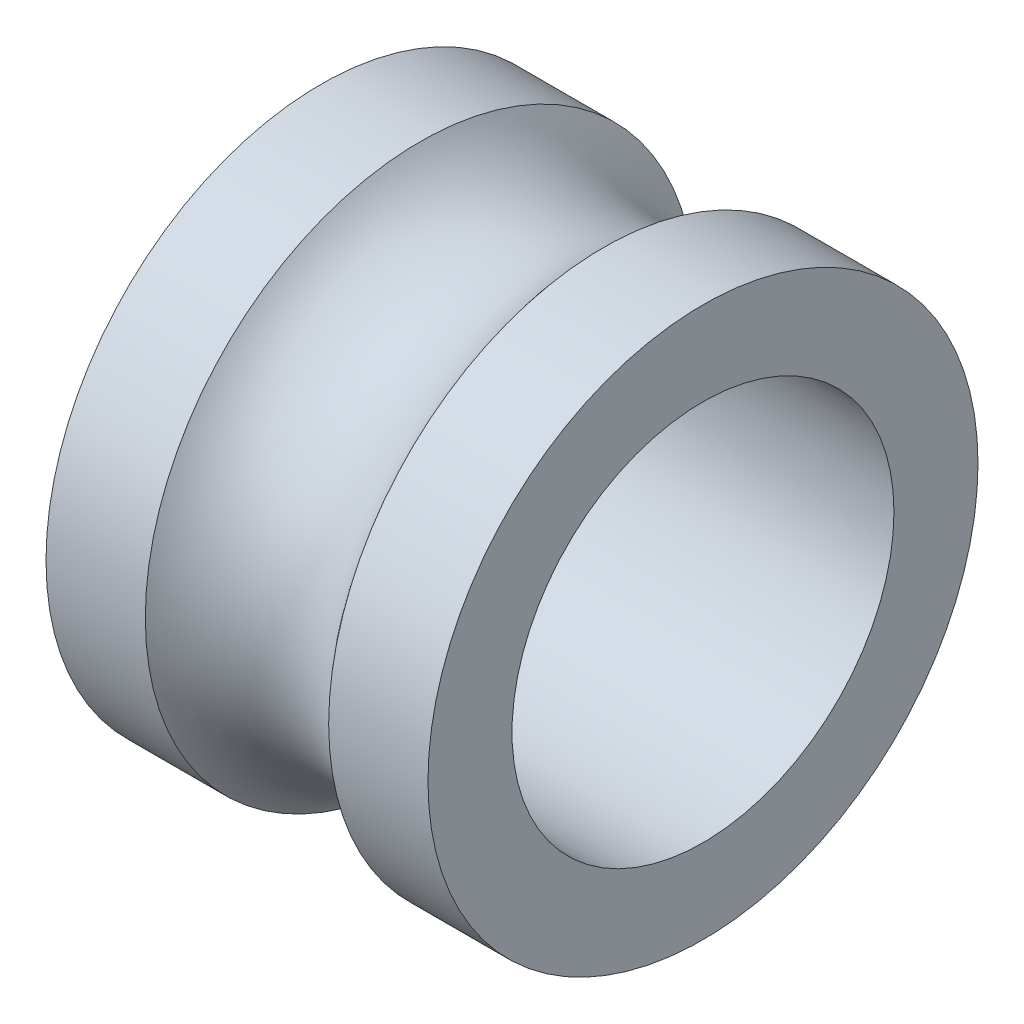
ISO-10303-21;
HEADER;
FILE_DESCRIPTION(('STEP AP214'),'2;1');
FILE_NAME('part.step','',(''),(''),'','','');
FILE_SCHEMA(('AUTOMOTIVE_DESIGN { 1 0 10303 214 1 1 1 1 }'));
ENDSEC;
DATA;
#1=APPLICATION_CONTEXT('core data for automotive mechanical design processes');
#2=APPLICATION_PROTOCOL_DEFINITION('international standard','automotive_design',2000,#1);
#3=PRODUCT_CONTEXT('',#1,'mechanical');
#4=PRODUCT('Part','Part','',(#3));
#5=PRODUCT_RELATED_PRODUCT_CATEGORY('part','',(#4));
#6=PRODUCT_DEFINITION_FORMATION('','',#4);
#7=PRODUCT_DEFINITION_CONTEXT('part definition',#1,'design');
#8=PRODUCT_DEFINITION('design','',#6,#7);
#9=PRODUCT_DEFINITION_SHAPE('','',#8);
#10=(LENGTH_UNIT() NAMED_UNIT(*) SI_UNIT(.MILLI.,.METRE.));
#11=(NAMED_UNIT(*) PLANE_ANGLE_UNIT() SI_UNIT($,.RADIAN.));
#12=(NAMED_UNIT(*) SI_UNIT($,.STERADIAN.) SOLID_ANGLE_UNIT());
#13=UNCERTAINTY_MEASURE_WITH_UNIT(LENGTH_MEASURE(1.E-05),#10,'distance_accuracy_value','');
#14=(GEOMETRIC_REPRESENTATION_CONTEXT(3) GLOBAL_UNCERTAINTY_ASSIGNED_CONTEXT((#13)) GLOBAL_UNIT_ASSIGNED_CONTEXT((#10,
#11,#12)) REPRESENTATION_CONTEXT('',''));
#15=CARTESIAN_POINT('',(0.,0.,0.));
#16=DIRECTION('',(0.,0.,1.));
#17=DIRECTION('',(1.,0.,0.));
#18=AXIS2_PLACEMENT_3D('',#15,#16,#17);
#19=CARTESIAN_POINT('',(2.5,3.6,0.));
#20=DIRECTION('',(1.,0.,0.));
#21=DIRECTION('',(0.,0.,-1.));
#22=AXIS2_PLACEMENT_3D('',#19,#20,#21);
#23=PLANE('',#22);
#24=CARTESIAN_POINT('',(2.5,0.,0.));
#25=DIRECTION('',(1.,0.,0.));
#26=DIRECTION('',(0.,0.,-1.));
#27=AXIS2_PLACEMENT_3D('',#24,#25,#26);
#28=CIRCLE('',#27,3.6);
#29=CARTESIAN_POINT('',(2.5,0.,-3.6));
#30=VERTEX_POINT('',#29);
#31=EDGE_CURVE('E59',#30,#30,#28,.T.);
#32=ORIENTED_EDGE('',*,*,#31,.T.);
#33=EDGE_LOOP('',(#32));
#34=FACE_BOUND('',#33,.T.);
#35=CARTESIAN_POINT('',(2.5,0.,0.));
#36=DIRECTION('',(1.,0.,0.));
#37=DIRECTION('',(0.,0.,-1.));
#38=AXIS2_PLACEMENT_3D('',#35,#36,#37);
#39=CIRCLE('',#38,2.5);
#40=CARTESIAN_POINT('',(2.5,0.,-2.5));
#41=VERTEX_POINT('',#40);
#42=EDGE_CURVE('E10',#41,#41,#39,.T.);
#43=ORIENTED_EDGE('',*,*,#42,.F.);
#44=EDGE_LOOP('',(#43));
#45=FACE_BOUND('',#44,.T.);
#46=ADVANCED_FACE('F37',(#34,#45),#23,.T.);
#47=CARTESIAN_POINT('',(0.,0.,0.));
#48=DIRECTION('',(1.,0.,0.));
#49=DIRECTION('',(0.,0.,-1.));
#50=AXIS2_PLACEMENT_3D('',#47,#48,#49);
#51=CYLINDRICAL_SURFACE('',#50,2.5);
#52=ORIENTED_EDGE('',*,*,#42,.T.);
#53=EDGE_LOOP('',(#52));
#54=FACE_BOUND('',#53,.T.);
#55=CARTESIAN_POINT('',(-2.5,0.,0.));
#56=DIRECTION('',(1.,0.,0.));
#57=DIRECTION('',(0.,0.,-1.));
#58=AXIS2_PLACEMENT_3D('',#55,#56,#57);
#59=CIRCLE('',#58,2.5);
#60=CARTESIAN_POINT('',(-2.5,0.,-2.5));
#61=VERTEX_POINT('',#60);
#62=EDGE_CURVE('E43',#61,#61,#59,.T.);
#63=ORIENTED_EDGE('',*,*,#62,.F.);
#64=EDGE_LOOP('',(#63));
#65=FACE_BOUND('',#64,.T.);
#66=ADVANCED_FACE('F77',(#54,#65),#51,.F.);
#67=CARTESIAN_POINT('',(-2.5,2.5,0.));
#68=DIRECTION('',(-1.,0.,0.));
#69=DIRECTION('',(0.,0.,1.));
#70=AXIS2_PLACEMENT_3D('',#67,#68,#69);
#71=PLANE('',#70);
#72=ORIENTED_EDGE('',*,*,#62,.T.);
#73=EDGE_LOOP('',(#72));
#74=FACE_BOUND('',#73,.T.);
#75=CARTESIAN_POINT('',(-2.5,0.,0.));
#76=DIRECTION('',(1.,0.,0.));
#77=DIRECTION('',(0.,0.,-1.));
#78=AXIS2_PLACEMENT_3D('',#75,#76,#77);
#79=CIRCLE('',#78,3.6);
#80=CARTESIAN_POINT('',(-2.5,0.,-3.6));
#81=VERTEX_POINT('',#80);
#82=EDGE_CURVE('E47',#81,#81,#79,.T.);
#83=ORIENTED_EDGE('',*,*,#82,.F.);
#84=EDGE_LOOP('',(#83));
#85=FACE_BOUND('',#84,.T.);
#86=ADVANCED_FACE('F81',(#74,#85),#71,.T.);
#87=CARTESIAN_POINT('',(0.,0.,0.));
#88=DIRECTION('',(1.,0.,0.));
#89=DIRECTION('',(0.,0.,-1.));
#90=AXIS2_PLACEMENT_3D('',#87,#88,#89);
#91=CYLINDRICAL_SURFACE('',#90,3.6);
#92=ORIENTED_EDGE('',*,*,#82,.T.);
#93=EDGE_LOOP('',(#92));
#94=FACE_BOUND('',#93,.T.);
#95=CARTESIAN_POINT('',(-1.2,0.,0.));
#96=DIRECTION('',(1.,0.,0.));
#97=DIRECTION('',(0.,0.,-1.));
#98=AXIS2_PLACEMENT_3D('',#95,#96,#97);
#99=CIRCLE('',#98,3.6);
#100=CARTESIAN_POINT('',(-1.2,0.,-3.6));
#101=VERTEX_POINT('',#100);
#102=EDGE_CURVE('E51',#101,#101,#99,.T.);
#103=ORIENTED_EDGE('',*,*,#102,.F.);
#104=EDGE_LOOP('',(#103));
#105=FACE_BOUND('',#104,.T.);
#106=ADVANCED_FACE('F73',(#94,#105),#91,.T.);
#107=CARTESIAN_POINT('',(0.,0.,0.));
#108=DIRECTION('',(1.,0.,0.));
#109=DIRECTION('',(0.,0.,-1.));
#110=AXIS2_PLACEMENT_3D('',#107,#108,#109);
#111=TOROIDAL_SURFACE('',#110,4.5,1.5);
#112=ORIENTED_EDGE('',*,*,#102,.T.);
#113=EDGE_LOOP('',(#112));
#114=FACE_BOUND('',#113,.T.);
#115=CARTESIAN_POINT('',(1.2,0.,0.));
#116=DIRECTION('',(1.,0.,0.));
#117=DIRECTION('',(0.,0.,-1.));
#118=AXIS2_PLACEMENT_3D('',#115,#116,#117);
#119=CIRCLE('',#118,3.6);
#120=CARTESIAN_POINT('',(1.2,0.,-3.6));
#121=VERTEX_POINT('',#120);
#122=EDGE_CURVE('E56',#121,#121,#119,.T.);
#123=ORIENTED_EDGE('',*,*,#122,.F.);
#124=EDGE_LOOP('',(#123));
#125=FACE_BOUND('',#124,.T.);
#126=ADVANCED_FACE('F67',(#114,#125),#111,.F.);
#127=CARTESIAN_POINT('',(0.,0.,0.));
#128=DIRECTION('',(1.,0.,0.));
#129=DIRECTION('',(0.,0.,-1.));
#130=AXIS2_PLACEMENT_3D('',#127,#128,#129);
#131=CYLINDRICAL_SURFACE('',#130,3.6);
#132=ORIENTED_EDGE('',*,*,#122,.T.);
#133=EDGE_LOOP('',(#132));
#134=FACE_BOUND('',#133,.T.);
#135=ORIENTED_EDGE('',*,*,#31,.F.);
#136=EDGE_LOOP('',(#135));
#137=FACE_BOUND('',#136,.T.);
#138=ADVANCED_FACE('F65',(#134,#137),#131,.T.);
#139=CLOSED_SHELL('',(#46,#66,#86,#106,#126,#138));
#140=MANIFOLD_SOLID_BREP('B2',#139);
#141=ADVANCED_BREP_SHAPE_REPRESENTATION('',(#18,#140),#14);
#142=SHAPE_DEFINITION_REPRESENTATION(#9,#141);
ENDSEC;
END-ISO-10303-21;
